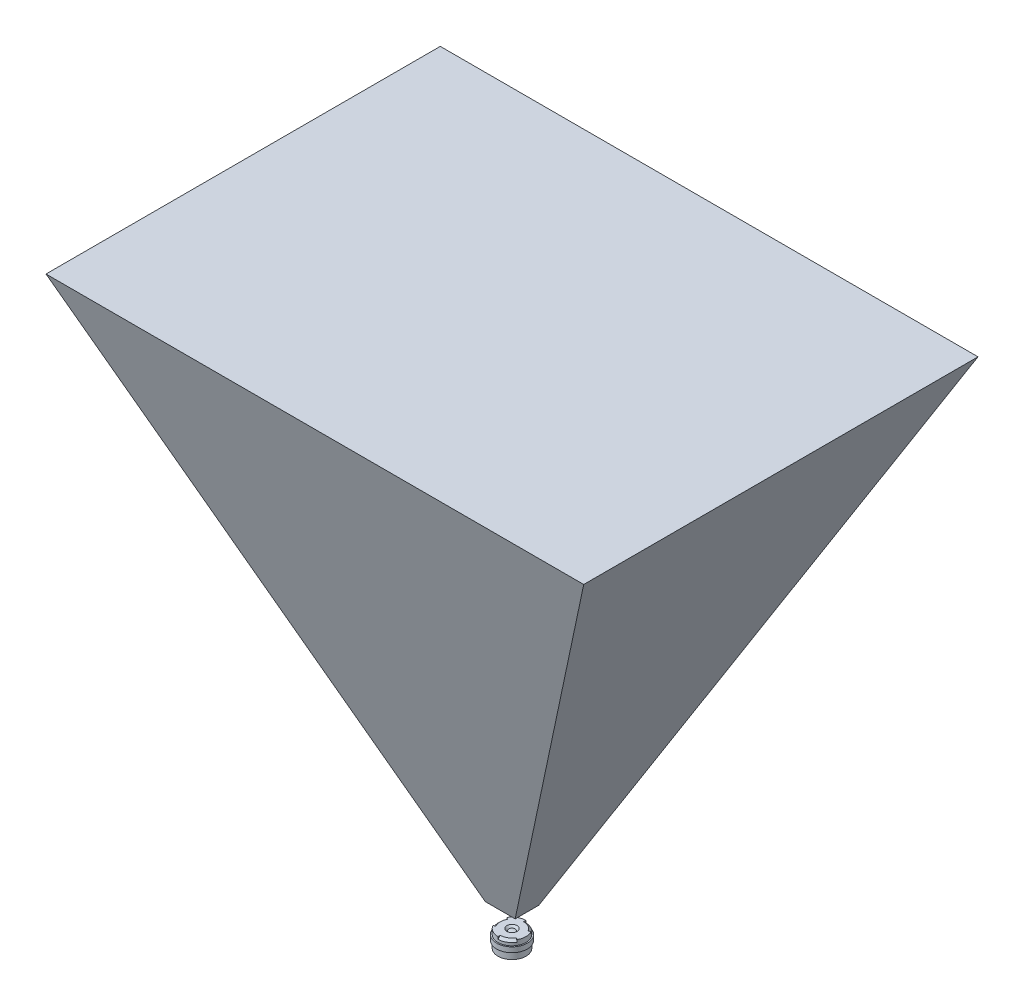
ISO-10303-21;
HEADER;
FILE_DESCRIPTION(('STEP AP214'),'2;1');
FILE_NAME('part.step','',(''),(''),'','','');
FILE_SCHEMA(('AUTOMOTIVE_DESIGN { 1 0 10303 214 1 1 1 1 }'));
ENDSEC;
DATA;
#1=APPLICATION_CONTEXT('core data for automotive mechanical design processes');
#2=APPLICATION_PROTOCOL_DEFINITION('international standard','automotive_design',2000,#1);
#3=PRODUCT_CONTEXT('',#1,'mechanical');
#4=PRODUCT('Part','Part','',(#3));
#5=PRODUCT_RELATED_PRODUCT_CATEGORY('part','',(#4));
#6=PRODUCT_DEFINITION_FORMATION('','',#4);
#7=PRODUCT_DEFINITION_CONTEXT('part definition',#1,'design');
#8=PRODUCT_DEFINITION('design','',#6,#7);
#9=PRODUCT_DEFINITION_SHAPE('','',#8);
#10=(LENGTH_UNIT() NAMED_UNIT(*) SI_UNIT(.MILLI.,.METRE.));
#11=(NAMED_UNIT(*) PLANE_ANGLE_UNIT() SI_UNIT($,.RADIAN.));
#12=(NAMED_UNIT(*) SI_UNIT($,.STERADIAN.) SOLID_ANGLE_UNIT());
#13=UNCERTAINTY_MEASURE_WITH_UNIT(LENGTH_MEASURE(1.E-05),#10,'distance_accuracy_value','');
#14=(GEOMETRIC_REPRESENTATION_CONTEXT(3) GLOBAL_UNCERTAINTY_ASSIGNED_CONTEXT((#13)) GLOBAL_UNIT_ASSIGNED_CONTEXT((#10,
#11,#12)) REPRESENTATION_CONTEXT('',''));
#15=CARTESIAN_POINT('',(0.,0.,0.));
#16=DIRECTION('',(0.,0.,1.));
#17=DIRECTION('',(1.,0.,0.));
#18=AXIS2_PLACEMENT_3D('',#15,#16,#17);
#19=CARTESIAN_POINT('',(100.,105.057826612841,38.7082344142105));
#20=DIRECTION('',(0.,-1.,0.));
#21=DIRECTION('',(0.,0.,-1.));
#22=AXIS2_PLACEMENT_3D('',#19,#20,#21);
#23=PLANE('',#22);
#24=DIRECTION('',(0.,0.,1.));
#25=VECTOR('',#24,1.);
#26=CARTESIAN_POINT('',(-52.7930029478063,105.057826612841,-38.7082344142105));
#27=LINE('',#26,#25);
#28=CARTESIAN_POINT('',(-52.7930029478063,105.057826612841,-38.7082344142105));
#29=VERTEX_POINT('',#28);
#30=CARTESIAN_POINT('',(-52.7930029478063,105.057826612841,38.7082344142105));
#31=VERTEX_POINT('',#30);
#32=EDGE_CURVE('E66',#29,#31,#27,.T.);
#33=ORIENTED_EDGE('',*,*,#32,.T.);
#34=DIRECTION('',(-1.,0.,0.));
#35=VECTOR('',#34,1.);
#36=CARTESIAN_POINT('',(100.,105.057826612841,38.7082344142105));
#37=LINE('',#36,#35);
#38=CARTESIAN_POINT('',(52.7930029478063,105.057826612841,38.7082344142105));
#39=VERTEX_POINT('',#38);
#40=EDGE_CURVE('E96',#39,#31,#37,.T.);
#41=ORIENTED_EDGE('',*,*,#40,.F.);
#42=DIRECTION('',(0.,0.,1.));
#43=VECTOR('',#42,1.);
#44=CARTESIAN_POINT('',(52.7930029478063,105.057826612841,-38.7082344142105));
#45=LINE('',#44,#43);
#46=CARTESIAN_POINT('',(52.7930029478063,105.057826612841,-38.7082344142105));
#47=VERTEX_POINT('',#46);
#48=EDGE_CURVE('E82',#47,#39,#45,.T.);
#49=ORIENTED_EDGE('',*,*,#48,.F.);
#50=DIRECTION('',(-1.,0.,0.));
#51=VECTOR('',#50,1.);
#52=CARTESIAN_POINT('',(100.,105.057826612841,-38.7082344142105));
#53=LINE('',#52,#51);
#54=EDGE_CURVE('E108',#47,#29,#53,.T.);
#55=ORIENTED_EDGE('',*,*,#54,.T.);
#56=EDGE_LOOP('',(#33,#41,#49,#55));
#57=FACE_BOUND('',#56,.T.);
#58=ADVANCED_FACE('F45',(#57),#23,.F.);
#59=CARTESIAN_POINT('',(100.,5.05782661284086,2.31121098759038));
#60=DIRECTION('',(0.,0.342020143325668,-0.939692620785909));
#61=DIRECTION('',(0.,0.939692620785909,0.342020143325668));
#62=AXIS2_PLACEMENT_3D('',#59,#60,#61);
#63=PLANE('',#62);
#64=DIRECTION('',(-0.424258256279285,0.850930418263275,0.309713343679521));
#65=VECTOR('',#64,1.);
#66=CARTESIAN_POINT('',(15.5929217707149,-32.1031187848726,-11.2142670143689));
#67=LINE('',#66,#65);
#68=CARTESIAN_POINT('',(-2.93484214246295,5.05782661284087,2.31121098759038));
#69=VERTEX_POINT('',#68);
#70=EDGE_CURVE('E99',#69,#31,#67,.T.);
#71=ORIENTED_EDGE('',*,*,#70,.F.);
#72=DIRECTION('',(-1.,0.,0.));
#73=VECTOR('',#72,1.);
#74=CARTESIAN_POINT('',(100.,5.05782661284086,2.31121098759038));
#75=LINE('',#74,#73);
#76=CARTESIAN_POINT('',(2.93484214246295,5.05782661284087,2.31121098759038));
#77=VERTEX_POINT('',#76);
#78=EDGE_CURVE('E98',#77,#69,#75,.T.);
#79=ORIENTED_EDGE('',*,*,#78,.F.);
#80=DIRECTION('',(-0.424258256279285,-0.850930418263275,-0.309713343679521));
#81=VECTOR('',#80,1.);
#82=CARTESIAN_POINT('',(20.4060918335129,40.0997323086032,15.0654216128111));
#83=LINE('',#82,#81);
#84=EDGE_CURVE('E85',#39,#77,#83,.T.);
#85=ORIENTED_EDGE('',*,*,#84,.F.);
#86=ORIENTED_EDGE('',*,*,#40,.T.);
#87=EDGE_LOOP('',(#71,#79,#85,#86));
#88=FACE_BOUND('',#87,.T.);
#89=ADVANCED_FACE('F95',(#88),#63,.F.);
#90=CARTESIAN_POINT('',(100.,5.05782661284086,2.31121098759038));
#91=DIRECTION('',(0.,1.,0.));
#92=DIRECTION('',(0.,0.,1.));
#93=AXIS2_PLACEMENT_3D('',#90,#91,#92);
#94=PLANE('',#93);
#95=DIRECTION('',(0.,0.,1.));
#96=VECTOR('',#95,1.);
#97=CARTESIAN_POINT('',(-2.93484214246295,5.05782661284087,-38.7082344142105));
#98=LINE('',#97,#96);
#99=CARTESIAN_POINT('',(-2.93484214246294,5.05782661284087,-2.31121098759039));
#100=VERTEX_POINT('',#99);
#101=EDGE_CURVE('E100',#100,#69,#98,.T.);
#102=ORIENTED_EDGE('',*,*,#101,.F.);
#103=DIRECTION('',(-1.,0.,0.));
#104=VECTOR('',#103,1.);
#105=CARTESIAN_POINT('',(100.,5.05782661284086,-2.31121098759038));
#106=LINE('',#105,#104);
#107=CARTESIAN_POINT('',(2.93484214246293,5.05782661284086,-2.31121098759038));
#108=VERTEX_POINT('',#107);
#109=EDGE_CURVE('E103',#108,#100,#106,.T.);
#110=ORIENTED_EDGE('',*,*,#109,.F.);
#111=DIRECTION('',(0.,0.,1.));
#112=VECTOR('',#111,1.);
#113=CARTESIAN_POINT('',(2.93484214246295,5.05782661284087,-38.7082344142105));
#114=LINE('',#113,#112);
#115=EDGE_CURVE('E59',#108,#77,#114,.T.);
#116=ORIENTED_EDGE('',*,*,#115,.T.);
#117=ORIENTED_EDGE('',*,*,#78,.T.);
#118=EDGE_LOOP('',(#102,#110,#116,#117));
#119=FACE_BOUND('',#118,.T.);
#120=ADVANCED_FACE('F117',(#119),#94,.F.);
#121=CARTESIAN_POINT('',(100.,5.05782661284086,-2.31121098759038));
#122=DIRECTION('',(0.,0.342020143325668,0.939692620785909));
#123=DIRECTION('',(0.,-0.939692620785909,0.342020143325668));
#124=AXIS2_PLACEMENT_3D('',#121,#122,#123);
#125=PLANE('',#124);
#126=DIRECTION('',(0.424258256279285,-0.850930418263275,0.309713343679521));
#127=VECTOR('',#126,1.);
#128=CARTESIAN_POINT('',(15.5929217707149,-32.1031187848726,11.2142670143689));
#129=LINE('',#128,#127);
#130=EDGE_CURVE('E13',#29,#100,#129,.T.);
#131=ORIENTED_EDGE('',*,*,#130,.F.);
#132=ORIENTED_EDGE('',*,*,#54,.F.);
#133=DIRECTION('',(0.424258256279285,0.850930418263275,-0.309713343679521));
#134=VECTOR('',#133,1.);
#135=CARTESIAN_POINT('',(20.4060918335129,40.0997323086032,-15.0654216128111));
#136=LINE('',#135,#134);
#137=EDGE_CURVE('E52',#108,#47,#136,.T.);
#138=ORIENTED_EDGE('',*,*,#137,.F.);
#139=ORIENTED_EDGE('',*,*,#109,.T.);
#140=EDGE_LOOP('',(#131,#132,#138,#139));
#141=FACE_BOUND('',#140,.T.);
#142=ADVANCED_FACE('F119',(#141),#125,.F.);
#143=CARTESIAN_POINT('',(2.93484214246295,5.05782661284087,-38.7082344142105));
#144=DIRECTION('',(0.894934361602024,-0.44619781310981,0.));
#145=DIRECTION('',(0.44619781310981,0.894934361602024,0.));
#146=AXIS2_PLACEMENT_3D('',#143,#144,#145);
#147=PLANE('',#146);
#148=ORIENTED_EDGE('',*,*,#84,.T.);
#149=ORIENTED_EDGE('',*,*,#115,.F.);
#150=ORIENTED_EDGE('',*,*,#137,.T.);
#151=ORIENTED_EDGE('',*,*,#48,.T.);
#152=EDGE_LOOP('',(#148,#149,#150,#151));
#153=FACE_BOUND('',#152,.T.);
#154=ADVANCED_FACE('F84',(#153),#147,.T.);
#155=CARTESIAN_POINT('',(-2.93484214246295,5.05782661284087,-38.7082344142105));
#156=DIRECTION('',(-0.894934361602024,-0.44619781310981,0.));
#157=DIRECTION('',(0.44619781310981,-0.894934361602024,0.));
#158=AXIS2_PLACEMENT_3D('',#155,#156,#157);
#159=PLANE('',#158);
#160=ORIENTED_EDGE('',*,*,#70,.T.);
#161=ORIENTED_EDGE('',*,*,#32,.F.);
#162=ORIENTED_EDGE('',*,*,#130,.T.);
#163=ORIENTED_EDGE('',*,*,#101,.T.);
#164=EDGE_LOOP('',(#160,#161,#162,#163));
#165=FACE_BOUND('',#164,.T.);
#166=ADVANCED_FACE('F114',(#165),#159,.T.);
#167=CLOSED_SHELL('',(#58,#89,#120,#142,#154,#166));
#168=MANIFOLD_SOLID_BREP('B2',#167);
#169=CARTESIAN_POINT('',(1.,0.8,0.));
#170=DIRECTION('',(0.,-1.,0.));
#171=DIRECTION('',(0.,0.,-1.));
#172=AXIS2_PLACEMENT_3D('',#169,#170,#171);
#173=PLANE('',#172);
#174=CARTESIAN_POINT('',(0.,0.8,0.));
#175=DIRECTION('',(0.,1.,0.));
#176=DIRECTION('',(0.,0.,1.));
#177=AXIS2_PLACEMENT_3D('',#174,#175,#176);
#178=CIRCLE('',#177,1.);
#179=CARTESIAN_POINT('',(0.,0.8,1.));
#180=VERTEX_POINT('',#179);
#181=EDGE_CURVE('E43',#180,#180,#178,.T.);
#182=ORIENTED_EDGE('',*,*,#181,.F.);
#183=EDGE_LOOP('',(#182));
#184=FACE_BOUND('',#183,.T.);
#185=DIRECTION('',(0.,0.,-1.));
#186=VECTOR('',#185,1.);
#187=CARTESIAN_POINT('',(0.,0.8,2.3));
#188=LINE('',#187,#186);
#189=CARTESIAN_POINT('',(0.,0.8,2.75));
#190=VERTEX_POINT('',#189);
#191=CARTESIAN_POINT('',(0.,0.8,2.3));
#192=VERTEX_POINT('',#191);
#193=EDGE_CURVE('E254',#190,#192,#188,.T.);
#194=ORIENTED_EDGE('',*,*,#193,.T.);
#195=CARTESIAN_POINT('',(0.,0.8,0.));
#196=DIRECTION('',(0.,1.,0.));
#197=DIRECTION('',(-0.866025403784443,0.,-0.499999999999992));
#198=AXIS2_PLACEMENT_3D('',#195,#196,#197);
#199=CIRCLE('',#198,2.3);
#200=CARTESIAN_POINT('',(1.99185842870422,0.8,1.14999999999998));
#201=VERTEX_POINT('',#200);
#202=EDGE_CURVE('E239',#192,#201,#199,.T.);
#203=ORIENTED_EDGE('',*,*,#202,.T.);
#204=DIRECTION('',(-0.866025403784443,0.,-0.499999999999992));
#205=VECTOR('',#204,1.);
#206=CARTESIAN_POINT('',(1.99185842870422,0.8,1.14999999999998));
#207=LINE('',#206,#205);
#208=CARTESIAN_POINT('',(2.38156986040722,0.8,1.37499999999998));
#209=VERTEX_POINT('',#208);
#210=EDGE_CURVE('E245',#209,#201,#207,.T.);
#211=ORIENTED_EDGE('',*,*,#210,.F.);
#212=CARTESIAN_POINT('',(0.,0.8,0.));
#213=DIRECTION('',(0.,1.,0.));
#214=DIRECTION('',(0.,0.,1.));
#215=AXIS2_PLACEMENT_3D('',#212,#213,#214);
#216=CIRCLE('',#215,2.75);
#217=CARTESIAN_POINT('',(2.38156986040721,0.8,-1.37499999999999));
#218=VERTEX_POINT('',#217);
#219=EDGE_CURVE('E325',#209,#218,#216,.T.);
#220=ORIENTED_EDGE('',*,*,#219,.T.);
#221=DIRECTION('',(-0.86602540378444,0.,0.499999999999998));
#222=VECTOR('',#221,1.);
#223=CARTESIAN_POINT('',(1.99185842870421,0.8,-1.15));
#224=LINE('',#223,#222);
#225=CARTESIAN_POINT('',(1.99185842870421,0.8,-1.15));
#226=VERTEX_POINT('',#225);
#227=EDGE_CURVE('E288',#218,#226,#224,.T.);
#228=ORIENTED_EDGE('',*,*,#227,.T.);
#229=CARTESIAN_POINT('',(0.,0.8,0.));
#230=DIRECTION('',(0.,1.,0.));
#231=DIRECTION('',(0.,0.,1.));
#232=AXIS2_PLACEMENT_3D('',#229,#230,#231);
#233=CIRCLE('',#232,2.3);
#234=CARTESIAN_POINT('',(0.,0.8,-2.3));
#235=VERTEX_POINT('',#234);
#236=EDGE_CURVE('E296',#226,#235,#233,.T.);
#237=ORIENTED_EDGE('',*,*,#236,.T.);
#238=DIRECTION('',(0.,0.,1.));
#239=VECTOR('',#238,1.);
#240=CARTESIAN_POINT('',(0.,0.8,-2.3));
#241=LINE('',#240,#239);
#242=CARTESIAN_POINT('',(0.,0.8,-2.75));
#243=VERTEX_POINT('',#242);
#244=EDGE_CURVE('E281',#243,#235,#241,.T.);
#245=ORIENTED_EDGE('',*,*,#244,.F.);
#246=CARTESIAN_POINT('',(-2.38156986040721,0.8,-1.37499999999999));
#247=VERTEX_POINT('',#246);
#248=EDGE_CURVE('E176',#243,#247,#216,.T.);
#249=ORIENTED_EDGE('',*,*,#248,.T.);
#250=DIRECTION('',(0.86602540378444,0.,0.499999999999998));
#251=VECTOR('',#250,1.);
#252=CARTESIAN_POINT('',(-1.99185842870421,0.8,-1.15));
#253=LINE('',#252,#251);
#254=CARTESIAN_POINT('',(-1.99185842870421,0.8,-1.15));
#255=VERTEX_POINT('',#254);
#256=EDGE_CURVE('E268',#247,#255,#253,.T.);
#257=ORIENTED_EDGE('',*,*,#256,.T.);
#258=CARTESIAN_POINT('',(0.,0.8,0.));
#259=DIRECTION('',(0.,1.,0.));
#260=DIRECTION('',(0.866025403784436,0.,-0.500000000000004));
#261=AXIS2_PLACEMENT_3D('',#258,#259,#260);
#262=CIRCLE('',#261,2.3);
#263=CARTESIAN_POINT('',(-1.9918584287042,0.8,1.15000000000001));
#264=VERTEX_POINT('',#263);
#265=EDGE_CURVE('E276',#255,#264,#262,.T.);
#266=ORIENTED_EDGE('',*,*,#265,.T.);
#267=DIRECTION('',(0.866025403784436,0.,-0.500000000000004));
#268=VECTOR('',#267,1.);
#269=CARTESIAN_POINT('',(-1.9918584287042,0.8,1.15000000000001));
#270=LINE('',#269,#268);
#271=CARTESIAN_POINT('',(-2.3815698604072,0.8,1.37500000000001));
#272=VERTEX_POINT('',#271);
#273=EDGE_CURVE('E257',#272,#264,#270,.T.);
#274=ORIENTED_EDGE('',*,*,#273,.F.);
#275=EDGE_CURVE('E327',#272,#190,#216,.T.);
#276=ORIENTED_EDGE('',*,*,#275,.T.);
#277=EDGE_LOOP('',(#194,#203,#211,#220,#228,#237,#245,#249,#257,#266,#274,#276));
#278=FACE_BOUND('',#277,.T.);
#279=ADVANCED_FACE('F168',(#184,#278),#173,.F.);
#280=CARTESIAN_POINT('',(0.,0.,0.));
#281=DIRECTION('',(0.,1.,0.));
#282=DIRECTION('',(0.,0.,1.));
#283=AXIS2_PLACEMENT_3D('',#280,#281,#282);
#284=CYLINDRICAL_SURFACE('',#283,2.75);
#285=CARTESIAN_POINT('',(0.,-0.2,0.));
#286=DIRECTION('',(0.,-1.,0.));
#287=DIRECTION('',(0.,0.,-1.));
#288=AXIS2_PLACEMENT_3D('',#285,#286,#287);
#289=CIRCLE('',#288,2.75);
#290=CARTESIAN_POINT('',(0.,-0.2,-2.75));
#291=VERTEX_POINT('',#290);
#292=EDGE_CURVE('E302',#291,#291,#289,.T.);
#293=ORIENTED_EDGE('',*,*,#292,.F.);
#294=EDGE_LOOP('',(#293));
#295=FACE_BOUND('',#294,.T.);
#296=DIRECTION('',(0.,1.,0.));
#297=VECTOR('',#296,1.);
#298=CARTESIAN_POINT('',(0.,0.8,2.75));
#299=LINE('',#298,#297);
#300=CARTESIAN_POINT('',(0.,0.349999999999999,2.75));
#301=VERTEX_POINT('',#300);
#302=EDGE_CURVE('E255',#301,#190,#299,.T.);
#303=ORIENTED_EDGE('',*,*,#302,.T.);
#304=ORIENTED_EDGE('',*,*,#275,.F.);
#305=DIRECTION('',(0.,1.,0.));
#306=VECTOR('',#305,1.);
#307=CARTESIAN_POINT('',(-2.3815698604072,0.8,1.37500000000001));
#308=LINE('',#307,#306);
#309=CARTESIAN_POINT('',(-2.3815698604072,0.349999999999999,1.37500000000001));
#310=VERTEX_POINT('',#309);
#311=EDGE_CURVE('E266',#310,#272,#308,.T.);
#312=ORIENTED_EDGE('',*,*,#311,.F.);
#313=CARTESIAN_POINT('',(0.,0.349999999999999,0.));
#314=DIRECTION('',(0.,1.,0.));
#315=DIRECTION('',(0.866025403784436,0.,-0.500000000000004));
#316=AXIS2_PLACEMENT_3D('',#313,#314,#315);
#317=CIRCLE('',#316,2.75);
#318=CARTESIAN_POINT('',(-2.38156986040721,0.349999999999999,-1.37499999999999));
#319=VERTEX_POINT('',#318);
#320=EDGE_CURVE('E279',#319,#310,#317,.T.);
#321=ORIENTED_EDGE('',*,*,#320,.F.);
#322=DIRECTION('',(0.,1.,0.));
#323=VECTOR('',#322,1.);
#324=CARTESIAN_POINT('',(-2.38156986040721,0.8,-1.37499999999999));
#325=LINE('',#324,#323);
#326=EDGE_CURVE('E273',#319,#247,#325,.T.);
#327=ORIENTED_EDGE('',*,*,#326,.T.);
#328=ORIENTED_EDGE('',*,*,#248,.F.);
#329=DIRECTION('',(0.,1.,0.));
#330=VECTOR('',#329,1.);
#331=CARTESIAN_POINT('',(0.,0.8,-2.75));
#332=LINE('',#331,#330);
#333=CARTESIAN_POINT('',(0.,0.349999999999999,-2.75));
#334=VERTEX_POINT('',#333);
#335=EDGE_CURVE('E286',#334,#243,#332,.T.);
#336=ORIENTED_EDGE('',*,*,#335,.F.);
#337=CARTESIAN_POINT('',(0.,0.349999999999999,0.));
#338=DIRECTION('',(0.,1.,0.));
#339=DIRECTION('',(0.,0.,1.));
#340=AXIS2_PLACEMENT_3D('',#337,#338,#339);
#341=CIRCLE('',#340,2.75);
#342=CARTESIAN_POINT('',(2.38156986040721,0.349999999999999,-1.37499999999999));
#343=VERTEX_POINT('',#342);
#344=EDGE_CURVE('E299',#343,#334,#341,.T.);
#345=ORIENTED_EDGE('',*,*,#344,.F.);
#346=DIRECTION('',(0.,1.,0.));
#347=VECTOR('',#346,1.);
#348=CARTESIAN_POINT('',(2.38156986040721,0.8,-1.37499999999999));
#349=LINE('',#348,#347);
#350=EDGE_CURVE('E293',#343,#218,#349,.T.);
#351=ORIENTED_EDGE('',*,*,#350,.T.);
#352=ORIENTED_EDGE('',*,*,#219,.F.);
#353=DIRECTION('',(0.,1.,0.));
#354=VECTOR('',#353,1.);
#355=CARTESIAN_POINT('',(2.38156986040722,0.8,1.37499999999998));
#356=LINE('',#355,#354);
#357=CARTESIAN_POINT('',(2.38156986040722,0.349999999999999,1.37499999999998));
#358=VERTEX_POINT('',#357);
#359=EDGE_CURVE('E244',#358,#209,#356,.T.);
#360=ORIENTED_EDGE('',*,*,#359,.F.);
#361=CARTESIAN_POINT('',(0.,0.349999999999999,0.));
#362=DIRECTION('',(0.,1.,0.));
#363=DIRECTION('',(-0.866025403784443,0.,-0.499999999999992));
#364=AXIS2_PLACEMENT_3D('',#361,#362,#363);
#365=CIRCLE('',#364,2.75);
#366=EDGE_CURVE('E242',#301,#358,#365,.T.);
#367=ORIENTED_EDGE('',*,*,#366,.F.);
#368=EDGE_LOOP('',(#303,#304,#312,#321,#327,#328,#336,#345,#351,#352,#360,#367));
#369=FACE_BOUND('',#368,.T.);
#370=ADVANCED_FACE('F337',(#295,#369),#284,.T.);
#371=CARTESIAN_POINT('',(0.,-1.2,0.));
#372=DIRECTION('',(0.,-1.,0.));
#373=DIRECTION('',(0.,0.,-1.));
#374=AXIS2_PLACEMENT_3D('',#371,#372,#373);
#375=CIRCLE('',#374,2.75);
#376=CARTESIAN_POINT('',(0.,-1.2,-2.75));
#377=VERTEX_POINT('',#376);
#378=EDGE_CURVE('E311',#377,#377,#375,.T.);
#379=ORIENTED_EDGE('',*,*,#378,.T.);
#380=EDGE_LOOP('',(#379));
#381=FACE_BOUND('',#380,.T.);
#382=CARTESIAN_POINT('',(0.,-2.55,0.));
#383=DIRECTION('',(0.,1.,0.));
#384=DIRECTION('',(0.,0.,1.));
#385=AXIS2_PLACEMENT_3D('',#382,#383,#384);
#386=CIRCLE('',#385,2.75);
#387=CARTESIAN_POINT('',(0.,-2.55,2.75));
#388=VERTEX_POINT('',#387);
#389=EDGE_CURVE('E323',#388,#388,#386,.T.);
#390=ORIENTED_EDGE('',*,*,#389,.T.);
#391=EDGE_LOOP('',(#390));
#392=FACE_BOUND('',#391,.T.);
#393=ADVANCED_FACE('F371',(#381,#392),#284,.T.);
#394=CARTESIAN_POINT('',(2.75,-2.55,0.));
#395=DIRECTION('',(0.,1.,0.));
#396=DIRECTION('',(0.,0.,1.));
#397=AXIS2_PLACEMENT_3D('',#394,#395,#396);
#398=PLANE('',#397);
#399=ORIENTED_EDGE('',*,*,#389,.F.);
#400=EDGE_LOOP('',(#399));
#401=FACE_BOUND('',#400,.T.);
#402=CARTESIAN_POINT('',(0.,-2.55,0.));
#403=DIRECTION('',(0.,1.,0.));
#404=DIRECTION('',(0.,0.,1.));
#405=AXIS2_PLACEMENT_3D('',#402,#403,#404);
#406=CIRCLE('',#405,2.1);
#407=CARTESIAN_POINT('',(0.,-2.55,2.1));
#408=VERTEX_POINT('',#407);
#409=EDGE_CURVE('E320',#408,#408,#406,.T.);
#410=ORIENTED_EDGE('',*,*,#409,.T.);
#411=EDGE_LOOP('',(#410));
#412=FACE_BOUND('',#411,.T.);
#413=ADVANCED_FACE('F376',(#401,#412),#398,.F.);
#414=CARTESIAN_POINT('',(0.,-2.25,0.));
#415=DIRECTION('',(0.,-1.,0.));
#416=DIRECTION('',(0.,0.,-1.));
#417=AXIS2_PLACEMENT_3D('',#414,#415,#416);
#418=CONICAL_SURFACE('',#417,1.8,0.78539816339745);
#419=ORIENTED_EDGE('',*,*,#409,.F.);
#420=EDGE_LOOP('',(#419));
#421=FACE_BOUND('',#420,.T.);
#422=CARTESIAN_POINT('',(0.,-2.25,0.));
#423=DIRECTION('',(0.,1.,0.));
#424=DIRECTION('',(0.,0.,1.));
#425=AXIS2_PLACEMENT_3D('',#422,#423,#424);
#426=CIRCLE('',#425,1.8);
#427=CARTESIAN_POINT('',(0.,-2.25,1.8));
#428=VERTEX_POINT('',#427);
#429=EDGE_CURVE('E317',#428,#428,#426,.T.);
#430=ORIENTED_EDGE('',*,*,#429,.T.);
#431=EDGE_LOOP('',(#430));
#432=FACE_BOUND('',#431,.T.);
#433=ADVANCED_FACE('F379',(#421,#432),#418,.F.);
#434=CARTESIAN_POINT('',(0.,3.,0.));
#435=DIRECTION('',(0.,1.,0.));
#436=DIRECTION('',(1.,0.,0.));
#437=AXIS2_PLACEMENT_3D('',#434,#435,#436);
#438=SPHERICAL_SURFACE('',#437,5.55);
#439=ORIENTED_EDGE('',*,*,#429,.F.);
#440=EDGE_LOOP('',(#439));
#441=FACE_BOUND('',#440,.T.);
#442=ADVANCED_FACE('F383',(#441),#438,.T.);
#443=CARTESIAN_POINT('',(2.75,-1.2,0.));
#444=DIRECTION('',(0.,-1.,0.));
#445=DIRECTION('',(0.,0.,-1.));
#446=AXIS2_PLACEMENT_3D('',#443,#444,#445);
#447=PLANE('',#446);
#448=CARTESIAN_POINT('',(0.,-1.2,0.));
#449=DIRECTION('',(0.,-1.,0.));
#450=DIRECTION('',(0.,0.,-1.));
#451=AXIS2_PLACEMENT_3D('',#448,#449,#450);
#452=CIRCLE('',#451,3.);
#453=CARTESIAN_POINT('',(0.,-1.2,-3.));
#454=VERTEX_POINT('',#453);
#455=EDGE_CURVE('E308',#454,#454,#452,.T.);
#456=ORIENTED_EDGE('',*,*,#455,.T.);
#457=EDGE_LOOP('',(#456));
#458=FACE_BOUND('',#457,.T.);
#459=ORIENTED_EDGE('',*,*,#378,.F.);
#460=EDGE_LOOP('',(#459));
#461=FACE_BOUND('',#460,.T.);
#462=ADVANCED_FACE('F387',(#458,#461),#447,.T.);
#463=CARTESIAN_POINT('',(0.,0.,0.));
#464=DIRECTION('',(0.,-1.,0.));
#465=DIRECTION('',(0.,0.,-1.));
#466=AXIS2_PLACEMENT_3D('',#463,#464,#465);
#467=CYLINDRICAL_SURFACE('',#466,3.);
#468=CARTESIAN_POINT('',(0.,-0.2,0.));
#469=DIRECTION('',(0.,-1.,0.));
#470=DIRECTION('',(0.,0.,-1.));
#471=AXIS2_PLACEMENT_3D('',#468,#469,#470);
#472=CIRCLE('',#471,3.);
#473=CARTESIAN_POINT('',(0.,-0.2,-3.));
#474=VERTEX_POINT('',#473);
#475=EDGE_CURVE('E305',#474,#474,#472,.T.);
#476=ORIENTED_EDGE('',*,*,#475,.T.);
#477=EDGE_LOOP('',(#476));
#478=FACE_BOUND('',#477,.T.);
#479=ORIENTED_EDGE('',*,*,#455,.F.);
#480=EDGE_LOOP('',(#479));
#481=FACE_BOUND('',#480,.T.);
#482=ADVANCED_FACE('F396',(#478,#481),#467,.T.);
#483=CARTESIAN_POINT('',(2.75,-0.2,0.));
#484=DIRECTION('',(0.,1.,0.));
#485=DIRECTION('',(0.,0.,1.));
#486=AXIS2_PLACEMENT_3D('',#483,#484,#485);
#487=PLANE('',#486);
#488=ORIENTED_EDGE('',*,*,#292,.T.);
#489=EDGE_LOOP('',(#488));
#490=FACE_BOUND('',#489,.T.);
#491=ORIENTED_EDGE('',*,*,#475,.F.);
#492=EDGE_LOOP('',(#491));
#493=FACE_BOUND('',#492,.T.);
#494=ADVANCED_FACE('F392',(#490,#493),#487,.T.);
#495=CARTESIAN_POINT('',(0.,-1.478125,0.));
#496=DIRECTION('',(0.,1.,0.));
#497=DIRECTION('',(1.,0.,0.));
#498=AXIS2_PLACEMENT_3D('',#495,#496,#497);
#499=SPHERICAL_SURFACE('',#498,2.003125);
#500=CARTESIAN_POINT('',(0.,0.425,0.));
#501=DIRECTION('',(0.,1.,0.));
#502=DIRECTION('',(0.,0.,1.));
#503=AXIS2_PLACEMENT_3D('',#500,#501,#502);
#504=CIRCLE('',#503,0.625);
#505=CARTESIAN_POINT('',(0.,0.425,0.625));
#506=VERTEX_POINT('',#505);
#507=EDGE_CURVE('E314',#506,#506,#504,.T.);
#508=ORIENTED_EDGE('',*,*,#507,.T.);
#509=EDGE_LOOP('',(#508));
#510=FACE_BOUND('',#509,.T.);
#511=ADVANCED_FACE('F389',(#510),#499,.T.);
#512=CARTESIAN_POINT('',(0.,0.8,0.));
#513=DIRECTION('',(0.,1.,0.));
#514=DIRECTION('',(0.,0.,1.));
#515=AXIS2_PLACEMENT_3D('',#512,#513,#514);
#516=CONICAL_SURFACE('',#515,1.,0.785398163397449);
#517=ORIENTED_EDGE('',*,*,#507,.F.);
#518=EDGE_LOOP('',(#517));
#519=FACE_BOUND('',#518,.T.);
#520=ORIENTED_EDGE('',*,*,#181,.T.);
#521=EDGE_LOOP('',(#520));
#522=FACE_BOUND('',#521,.T.);
#523=ADVANCED_FACE('F170',(#519,#522),#516,.F.);
#524=CARTESIAN_POINT('',(0.,0.8,0.));
#525=DIRECTION('',(0.,-1.,0.));
#526=DIRECTION('',(0.,0.,-1.));
#527=AXIS2_PLACEMENT_3D('',#524,#525,#526);
#528=CONICAL_SURFACE('',#527,2.3,0.785398163397448);
#529=DIRECTION('',(0.612372435695795,-0.707106781186547,-0.353553390593272));
#530=VECTOR('',#529,1.);
#531=CARTESIAN_POINT('',(2.38156986040721,0.349999999999999,-1.37499999999999));
#532=LINE('',#531,#530);
#533=EDGE_CURVE('E291',#226,#343,#532,.T.);
#534=ORIENTED_EDGE('',*,*,#533,.T.);
#535=ORIENTED_EDGE('',*,*,#344,.T.);
#536=DIRECTION('',(0.,-0.707106781186547,-0.707106781186547));
#537=VECTOR('',#536,1.);
#538=CARTESIAN_POINT('',(0.,0.349999999999999,-2.75));
#539=LINE('',#538,#537);
#540=EDGE_CURVE('E284',#235,#334,#539,.T.);
#541=ORIENTED_EDGE('',*,*,#540,.F.);
#542=ORIENTED_EDGE('',*,*,#236,.F.);
#543=EDGE_LOOP('',(#534,#535,#541,#542));
#544=FACE_BOUND('',#543,.T.);
#545=ADVANCED_FACE('F340',(#544),#528,.T.);
#546=CARTESIAN_POINT('',(0.,0.,0.));
#547=DIRECTION('',(-0.499999999999998,0.,-0.86602540378444));
#548=DIRECTION('',(-0.86602540378444,0.,0.499999999999998));
#549=AXIS2_PLACEMENT_3D('',#546,#547,#548);
#550=PLANE('',#549);
#551=ORIENTED_EDGE('',*,*,#227,.F.);
#552=ORIENTED_EDGE('',*,*,#350,.F.);
#553=ORIENTED_EDGE('',*,*,#533,.F.);
#554=EDGE_LOOP('',(#551,#552,#553));
#555=FACE_BOUND('',#554,.T.);
#556=ADVANCED_FACE('F335',(#555),#550,.T.);
#557=CARTESIAN_POINT('',(0.,0.,0.));
#558=DIRECTION('',(-1.,0.,0.));
#559=DIRECTION('',(0.,0.,1.));
#560=AXIS2_PLACEMENT_3D('',#557,#558,#559);
#561=PLANE('',#560);
#562=ORIENTED_EDGE('',*,*,#244,.T.);
#563=ORIENTED_EDGE('',*,*,#540,.T.);
#564=ORIENTED_EDGE('',*,*,#335,.T.);
#565=EDGE_LOOP('',(#562,#563,#564));
#566=FACE_BOUND('',#565,.T.);
#567=ADVANCED_FACE('F408',(#566),#561,.F.);
#568=CARTESIAN_POINT('',(0.,0.8,0.));
#569=DIRECTION('',(0.,-1.,0.));
#570=DIRECTION('',(-0.866025403784436,0.,0.500000000000004));
#571=AXIS2_PLACEMENT_3D('',#568,#569,#570);
#572=CONICAL_SURFACE('',#571,2.3,0.785398163397448);
#573=DIRECTION('',(-0.612372435695795,-0.707106781186547,-0.353553390593272));
#574=VECTOR('',#573,1.);
#575=CARTESIAN_POINT('',(-2.38156986040721,0.349999999999999,-1.37499999999999));
#576=LINE('',#575,#574);
#577=EDGE_CURVE('E271',#255,#319,#576,.T.);
#578=ORIENTED_EDGE('',*,*,#577,.T.);
#579=ORIENTED_EDGE('',*,*,#320,.T.);
#580=DIRECTION('',(-0.612372435695793,-0.707106781186547,0.353553390593277));
#581=VECTOR('',#580,1.);
#582=CARTESIAN_POINT('',(-2.3815698604072,0.349999999999999,1.37500000000001));
#583=LINE('',#582,#581);
#584=EDGE_CURVE('E191',#264,#310,#583,.T.);
#585=ORIENTED_EDGE('',*,*,#584,.F.);
#586=ORIENTED_EDGE('',*,*,#265,.F.);
#587=EDGE_LOOP('',(#578,#579,#585,#586));
#588=FACE_BOUND('',#587,.T.);
#589=ADVANCED_FACE('F351',(#588),#572,.T.);
#590=CARTESIAN_POINT('',(0.,0.,0.));
#591=DIRECTION('',(-0.499999999999998,0.,0.86602540378444));
#592=DIRECTION('',(0.86602540378444,0.,0.499999999999998));
#593=AXIS2_PLACEMENT_3D('',#590,#591,#592);
#594=PLANE('',#593);
#595=ORIENTED_EDGE('',*,*,#256,.F.);
#596=ORIENTED_EDGE('',*,*,#326,.F.);
#597=ORIENTED_EDGE('',*,*,#577,.F.);
#598=EDGE_LOOP('',(#595,#596,#597));
#599=FACE_BOUND('',#598,.T.);
#600=ADVANCED_FACE('F347',(#599),#594,.T.);
#601=CARTESIAN_POINT('',(0.,0.,0.));
#602=DIRECTION('',(0.500000000000004,0.,0.866025403784436));
#603=DIRECTION('',(0.866025403784436,0.,-0.500000000000004));
#604=AXIS2_PLACEMENT_3D('',#601,#602,#603);
#605=PLANE('',#604);
#606=ORIENTED_EDGE('',*,*,#273,.T.);
#607=ORIENTED_EDGE('',*,*,#584,.T.);
#608=ORIENTED_EDGE('',*,*,#311,.T.);
#609=EDGE_LOOP('',(#606,#607,#608));
#610=FACE_BOUND('',#609,.T.);
#611=ADVANCED_FACE('F352',(#610),#605,.F.);
#612=CARTESIAN_POINT('',(0.,0.8,0.));
#613=DIRECTION('',(0.,-1.,0.));
#614=DIRECTION('',(0.866025403784443,0.,0.499999999999992));
#615=AXIS2_PLACEMENT_3D('',#612,#613,#614);
#616=CONICAL_SURFACE('',#615,2.3,0.785398163397448);
#617=DIRECTION('',(0.,-0.707106781186547,0.707106781186547));
#618=VECTOR('',#617,1.);
#619=CARTESIAN_POINT('',(0.,0.349999999999999,2.75));
#620=LINE('',#619,#618);
#621=EDGE_CURVE('E260',#192,#301,#620,.T.);
#622=ORIENTED_EDGE('',*,*,#621,.T.);
#623=ORIENTED_EDGE('',*,*,#366,.T.);
#624=DIRECTION('',(0.612372435695798,-0.707106781186547,0.353553390593268));
#625=VECTOR('',#624,1.);
#626=CARTESIAN_POINT('',(2.38156986040722,0.349999999999999,1.37499999999998));
#627=LINE('',#626,#625);
#628=EDGE_CURVE('E183',#201,#358,#627,.T.);
#629=ORIENTED_EDGE('',*,*,#628,.F.);
#630=ORIENTED_EDGE('',*,*,#202,.F.);
#631=EDGE_LOOP('',(#622,#623,#629,#630));
#632=FACE_BOUND('',#631,.T.);
#633=ADVANCED_FACE('F237',(#632),#616,.T.);
#634=CARTESIAN_POINT('',(0.,0.,0.));
#635=DIRECTION('',(1.,0.,0.));
#636=DIRECTION('',(0.,0.,-1.));
#637=AXIS2_PLACEMENT_3D('',#634,#635,#636);
#638=PLANE('',#637);
#639=ORIENTED_EDGE('',*,*,#193,.F.);
#640=ORIENTED_EDGE('',*,*,#302,.F.);
#641=ORIENTED_EDGE('',*,*,#621,.F.);
#642=EDGE_LOOP('',(#639,#640,#641));
#643=FACE_BOUND('',#642,.T.);
#644=ADVANCED_FACE('F355',(#643),#638,.T.);
#645=CARTESIAN_POINT('',(0.,0.,0.));
#646=DIRECTION('',(0.499999999999992,0.,-0.866025403784443));
#647=DIRECTION('',(-0.866025403784443,0.,-0.499999999999992));
#648=AXIS2_PLACEMENT_3D('',#645,#646,#647);
#649=PLANE('',#648);
#650=ORIENTED_EDGE('',*,*,#210,.T.);
#651=ORIENTED_EDGE('',*,*,#628,.T.);
#652=ORIENTED_EDGE('',*,*,#359,.T.);
#653=EDGE_LOOP('',(#650,#651,#652));
#654=FACE_BOUND('',#653,.T.);
#655=ADVANCED_FACE('F248',(#654),#649,.F.);
#656=CLOSED_SHELL('',(#279,#370,#393,#413,#433,#442,#462,#482,#494,#511,#523,#545,#556,#567,
#589,#600,#611,#633,#644,#655));
#657=MANIFOLD_SOLID_BREP('B7',#656);
#658=ADVANCED_BREP_SHAPE_REPRESENTATION('',(#18,#168,#657),#14);
#659=SHAPE_DEFINITION_REPRESENTATION(#9,#658);
ENDSEC;
END-ISO-10303-21;
